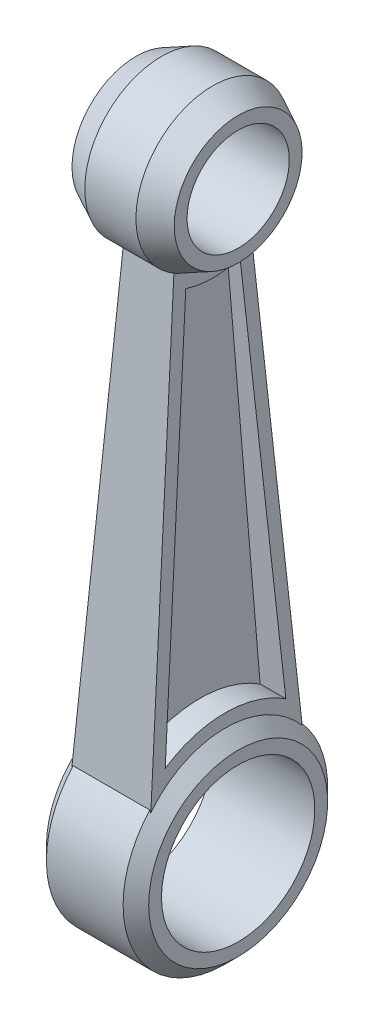
ISO-10303-21;
HEADER;
FILE_DESCRIPTION(('STEP AP214'),'2;1');
FILE_NAME('part.step','',(''),(''),'','','');
FILE_SCHEMA(('AUTOMOTIVE_DESIGN { 1 0 10303 214 1 1 1 1 }'));
ENDSEC;
DATA;
#1=APPLICATION_CONTEXT('core data for automotive mechanical design processes');
#2=APPLICATION_PROTOCOL_DEFINITION('international standard','automotive_design',2000,#1);
#3=PRODUCT_CONTEXT('',#1,'mechanical');
#4=PRODUCT('Part','Part','',(#3));
#5=PRODUCT_RELATED_PRODUCT_CATEGORY('part','',(#4));
#6=PRODUCT_DEFINITION_FORMATION('','',#4);
#7=PRODUCT_DEFINITION_CONTEXT('part definition',#1,'design');
#8=PRODUCT_DEFINITION('design','',#6,#7);
#9=PRODUCT_DEFINITION_SHAPE('','',#8);
#10=(LENGTH_UNIT() NAMED_UNIT(*) SI_UNIT(.MILLI.,.METRE.));
#11=(NAMED_UNIT(*) PLANE_ANGLE_UNIT() SI_UNIT($,.RADIAN.));
#12=(NAMED_UNIT(*) SI_UNIT($,.STERADIAN.) SOLID_ANGLE_UNIT());
#13=UNCERTAINTY_MEASURE_WITH_UNIT(LENGTH_MEASURE(1.E-05),#10,'distance_accuracy_value','');
#14=(GEOMETRIC_REPRESENTATION_CONTEXT(3) GLOBAL_UNCERTAINTY_ASSIGNED_CONTEXT((#13)) GLOBAL_UNIT_ASSIGNED_CONTEXT((#10,
#11,#12)) REPRESENTATION_CONTEXT('',''));
#15=CARTESIAN_POINT('',(0.,0.,0.));
#16=DIRECTION('',(0.,0.,1.));
#17=DIRECTION('',(1.,0.,0.));
#18=AXIS2_PLACEMENT_3D('',#15,#16,#17);
#19=CARTESIAN_POINT('',(0.,0.,0.));
#20=DIRECTION('',(-1.,0.,0.));
#21=DIRECTION('',(0.,0.,1.));
#22=AXIS2_PLACEMENT_3D('',#19,#20,#21);
#23=CYLINDRICAL_SURFACE('',#22,6.);
#24=CARTESIAN_POINT('',(4.,0.,0.));
#25=DIRECTION('',(-1.,0.,0.));
#26=DIRECTION('',(0.,0.,1.));
#27=AXIS2_PLACEMENT_3D('',#24,#25,#26);
#28=CIRCLE('',#27,6.);
#29=CARTESIAN_POINT('',(4.,0.,6.));
#30=VERTEX_POINT('',#29);
#31=EDGE_CURVE('E295',#30,#30,#28,.T.);
#32=ORIENTED_EDGE('',*,*,#31,.F.);
#33=EDGE_LOOP('',(#32));
#34=FACE_BOUND('',#33,.T.);
#35=CARTESIAN_POINT('',(-4.,0.,0.));
#36=DIRECTION('',(-1.,0.,0.));
#37=DIRECTION('',(0.,0.,1.));
#38=AXIS2_PLACEMENT_3D('',#35,#36,#37);
#39=CIRCLE('',#38,6.);
#40=CARTESIAN_POINT('',(-4.,0.,6.));
#41=VERTEX_POINT('',#40);
#42=EDGE_CURVE('E222',#41,#41,#39,.T.);
#43=ORIENTED_EDGE('',*,*,#42,.T.);
#44=EDGE_LOOP('',(#43));
#45=FACE_BOUND('',#44,.T.);
#46=ADVANCED_FACE('F38',(#34,#45),#23,.F.);
#47=CARTESIAN_POINT('',(4.,6.,0.));
#48=DIRECTION('',(-1.,0.,0.));
#49=DIRECTION('',(0.,0.,1.));
#50=AXIS2_PLACEMENT_3D('',#47,#48,#49);
#51=PLANE('',#50);
#52=CARTESIAN_POINT('',(4.,0.,0.));
#53=DIRECTION('',(-1.,0.,0.));
#54=DIRECTION('',(0.,0.,1.));
#55=AXIS2_PLACEMENT_3D('',#52,#53,#54);
#56=CIRCLE('',#55,7.);
#57=CARTESIAN_POINT('',(4.,0.,7.));
#58=VERTEX_POINT('',#57);
#59=EDGE_CURVE('E298',#58,#58,#56,.T.);
#60=ORIENTED_EDGE('',*,*,#59,.F.);
#61=EDGE_LOOP('',(#60));
#62=FACE_BOUND('',#61,.T.);
#63=ORIENTED_EDGE('',*,*,#31,.T.);
#64=EDGE_LOOP('',(#63));
#65=FACE_BOUND('',#64,.T.);
#66=ADVANCED_FACE('F286',(#62,#65),#51,.F.);
#67=CARTESIAN_POINT('',(4.,0.,0.));
#68=DIRECTION('',(-1.,0.,0.));
#69=DIRECTION('',(0.,0.,1.));
#70=AXIS2_PLACEMENT_3D('',#67,#68,#69);
#71=CONICAL_SURFACE('',#70,7.,0.785398163397448);
#72=CARTESIAN_POINT('',(3.25,0.25,0.));
#73=DIRECTION('',(0.9994801143397,0.032241294010958,0.));
#74=DIRECTION('',(-0.032241294010958,0.9994801143397,0.));
#75=AXIS2_PLACEMENT_3D('',#72,#73,#74);
#76=ELLIPSE('',#75,7.75403120963541,7.74596669241483);
#77=CARTESIAN_POINT('',(3.08888077576671,5.24469595123218,-5.92275035428325));
#78=VERTEX_POINT('',#77);
#79=CARTESIAN_POINT('',(3.08888077576671,5.24469595123218,5.92275035428325));
#80=VERTEX_POINT('',#79);
#81=EDGE_CURVE('E616',#78,#80,#76,.T.);
#82=ORIENTED_EDGE('',*,*,#81,.T.);
#83=CARTESIAN_POINT('',(3.11854575595028,5.19505550480803,5.92694856591595));
#84=CARTESIAN_POINT('',(3.09894655584697,5.22796007612366,5.92416574738757));
#85=CARTESIAN_POINT('',(3.07925147549856,5.26080718765726,5.92138778837079));
#86=CARTESIAN_POINT('',(3.03966955682412,5.32638648699748,5.91584158971249));
#87=CARTESIAN_POINT('',(3.01978271852244,5.35911867481869,5.91307335006974));
#88=CARTESIAN_POINT('',(2.9998,5.39179340287246,5.91030996993737));
#89=B_SPLINE_CURVE_WITH_KNOTS('',3,(#83,#84,#85,#86,#87,#88),.UNSPECIFIED.,.F.,.F.,(4,2,4),(0.,
0.115199452433468,0.230398890241465),.UNSPECIFIED.);
#90=CARTESIAN_POINT('',(3.,5.39146631945272,5.91033763216679));
#91=VERTEX_POINT('',#90);
#92=EDGE_CURVE('E392',#80,#91,#89,.T.);
#93=ORIENTED_EDGE('',*,*,#92,.T.);
#94=CARTESIAN_POINT('',(3.,0.,0.));
#95=DIRECTION('',(-1.,0.,0.));
#96=DIRECTION('',(0.,0.,1.));
#97=AXIS2_PLACEMENT_3D('',#94,#95,#96);
#98=CIRCLE('',#97,8.);
#99=CARTESIAN_POINT('',(3.,5.39146631945272,-5.91033763216679));
#100=VERTEX_POINT('',#99);
#101=EDGE_CURVE('E303',#100,#91,#98,.T.);
#102=ORIENTED_EDGE('',*,*,#101,.F.);
#103=CARTESIAN_POINT('',(2.9998,5.39179340287246,-5.91030996993737));
#104=CARTESIAN_POINT('',(3.01978271852244,5.35911867481869,-5.91307335006974));
#105=CARTESIAN_POINT('',(3.03966955682412,5.32638648699748,-5.91584158971249));
#106=CARTESIAN_POINT('',(3.07925147549855,5.26080718765726,-5.92138778837078));
#107=CARTESIAN_POINT('',(3.09894655584697,5.22796007612367,-5.92416574738757));
#108=CARTESIAN_POINT('',(3.11854575595027,5.19505550480804,-5.92694856591595));
#109=B_SPLINE_CURVE_WITH_KNOTS('',3,(#103,#104,#105,#106,#107,#108),.UNSPECIFIED.,.F.,.F.,(4,2,
4),(0.,0.115199437807991,0.230398890241453),.UNSPECIFIED.);
#110=EDGE_CURVE('E65',#100,#78,#109,.T.);
#111=ORIENTED_EDGE('',*,*,#110,.T.);
#112=EDGE_LOOP('',(#82,#93,#102,#111));
#113=FACE_BOUND('',#112,.T.);
#114=ORIENTED_EDGE('',*,*,#59,.T.);
#115=EDGE_LOOP('',(#114));
#116=FACE_BOUND('',#115,.T.);
#117=ADVANCED_FACE('F291',(#113,#116),#71,.T.);
#118=CARTESIAN_POINT('',(0.,0.,0.));
#119=DIRECTION('',(-1.,0.,0.));
#120=DIRECTION('',(0.,0.,1.));
#121=AXIS2_PLACEMENT_3D('',#118,#119,#120);
#122=CYLINDRICAL_SURFACE('',#121,8.);
#123=ORIENTED_EDGE('',*,*,#101,.T.);
#124=DIRECTION('',(-1.,0.,0.));
#125=VECTOR('',#124,1.);
#126=CARTESIAN_POINT('',(0.,5.39146631945272,5.91033763216679));
#127=LINE('',#126,#125);
#128=CARTESIAN_POINT('',(-3.,5.39146631945272,5.91033763216679));
#129=VERTEX_POINT('',#128);
#130=EDGE_CURVE('E300',#91,#129,#127,.T.);
#131=ORIENTED_EDGE('',*,*,#130,.T.);
#132=CARTESIAN_POINT('',(-3.,0.,0.));
#133=DIRECTION('',(-1.,0.,0.));
#134=DIRECTION('',(0.,0.,1.));
#135=AXIS2_PLACEMENT_3D('',#132,#133,#134);
#136=CIRCLE('',#135,8.);
#137=CARTESIAN_POINT('',(-3.,5.39146631945272,-5.91033763216679));
#138=VERTEX_POINT('',#137);
#139=EDGE_CURVE('E274',#138,#129,#136,.T.);
#140=ORIENTED_EDGE('',*,*,#139,.F.);
#141=DIRECTION('',(-1.,0.,0.));
#142=VECTOR('',#141,1.);
#143=CARTESIAN_POINT('',(0.,5.39146631945272,-5.91033763216679));
#144=LINE('',#143,#142);
#145=EDGE_CURVE('E297',#138,#100,#144,.F.);
#146=ORIENTED_EDGE('',*,*,#145,.T.);
#147=EDGE_LOOP('',(#123,#131,#140,#146));
#148=FACE_BOUND('',#147,.T.);
#149=ADVANCED_FACE('F404',(#148),#122,.T.);
#150=CARTESIAN_POINT('',(40.0032823696505,39.8038475772934,3.));
#151=DIRECTION('',(0.,0.0842715600283298,0.996442825339413));
#152=DIRECTION('',(0.,-0.996442825339413,0.0842715600283299));
#153=AXIS2_PLACEMENT_3D('',#150,#151,#152);
#154=PLANE('',#153);
#155=ORIENTED_EDGE('',*,*,#92,.F.);
#156=DIRECTION('',(-0.0321267246803745,0.995928465091609,-0.0842280593483142));
#157=VECTOR('',#156,1.);
#158=CARTESIAN_POINT('',(2.01332038910499,38.5870679377456,3.10290597295482));
#159=LINE('',#158,#157);
#160=CARTESIAN_POINT('',(1.97406943299054,39.8038475772934,3.));
#161=VERTEX_POINT('',#160);
#162=EDGE_CURVE('E612',#80,#161,#159,.T.);
#163=ORIENTED_EDGE('',*,*,#162,.T.);
#164=DIRECTION('',(-1.,0.,0.));
#165=VECTOR('',#164,1.);
#166=CARTESIAN_POINT('',(40.0032823696505,39.8038475772934,3.));
#167=LINE('',#166,#165);
#168=CARTESIAN_POINT('',(-1.97406943299054,39.8038475772934,3.));
#169=VERTEX_POINT('',#168);
#170=EDGE_CURVE('E394',#161,#169,#167,.T.);
#171=ORIENTED_EDGE('',*,*,#170,.T.);
#172=DIRECTION('',(0.0321267246803745,0.995928465091609,-0.0842280593483142));
#173=VECTOR('',#172,1.);
#174=CARTESIAN_POINT('',(-2.01332038910499,38.5870679377456,3.10290597295482));
#175=LINE('',#174,#173);
#176=CARTESIAN_POINT('',(-3.08888077576671,5.24469595123218,5.92275035428325));
#177=VERTEX_POINT('',#176);
#178=EDGE_CURVE('E643',#177,#169,#175,.T.);
#179=ORIENTED_EDGE('',*,*,#178,.F.);
#180=CARTESIAN_POINT('',(-3.11854575595028,5.19505550480803,5.92694856591595));
#181=CARTESIAN_POINT('',(-3.09894655584697,5.22796007612366,5.92416574738757));
#182=CARTESIAN_POINT('',(-3.07925147549856,5.26080718765726,5.92138778837079));
#183=CARTESIAN_POINT('',(-3.03966955682412,5.32638648699748,5.91584158971249));
#184=CARTESIAN_POINT('',(-3.01978271852244,5.35911867481869,5.91307335006974));
#185=CARTESIAN_POINT('',(-2.9998,5.39179340287246,5.91030996993737));
#186=B_SPLINE_CURVE_WITH_KNOTS('',3,(#180,#181,#182,#183,#184,#185),.UNSPECIFIED.,.F.,.F.,(4,2,
4),(0.,0.115199452433468,0.230398890241465),.UNSPECIFIED.);
#187=EDGE_CURVE('E264',#177,#129,#186,.T.);
#188=ORIENTED_EDGE('',*,*,#187,.T.);
#189=ORIENTED_EDGE('',*,*,#130,.F.);
#190=EDGE_LOOP('',(#155,#163,#171,#179,#188,#189));
#191=FACE_BOUND('',#190,.T.);
#192=ADVANCED_FACE('F382',(#191),#154,.T.);
#193=CARTESIAN_POINT('',(40.0032823696505,4.33128156554154,-6.));
#194=DIRECTION('',(0.,0.0842715600283299,-0.996442825339413));
#195=DIRECTION('',(0.,0.996442825339413,0.0842715600283299));
#196=AXIS2_PLACEMENT_3D('',#193,#194,#195);
#197=PLANE('',#196);
#198=ORIENTED_EDGE('',*,*,#110,.F.);
#199=ORIENTED_EDGE('',*,*,#145,.F.);
#200=CARTESIAN_POINT('',(-2.9998,5.39179340287246,-5.91030996993737));
#201=CARTESIAN_POINT('',(-3.01978271852244,5.35911867481869,-5.91307335006974));
#202=CARTESIAN_POINT('',(-3.03966955682412,5.32638648699748,-5.91584158971249));
#203=CARTESIAN_POINT('',(-3.07925147549855,5.26080718765726,-5.92138778837078));
#204=CARTESIAN_POINT('',(-3.09894655584697,5.22796007612367,-5.92416574738757));
#205=CARTESIAN_POINT('',(-3.11854575595027,5.19505550480804,-5.92694856591595));
#206=B_SPLINE_CURVE_WITH_KNOTS('',3,(#200,#201,#202,#203,#204,#205),.UNSPECIFIED.,.F.,.F.,(4,2,
4),(0.,0.115199437807991,0.230398890241453),.UNSPECIFIED.);
#207=CARTESIAN_POINT('',(-3.08888077576671,5.24469595123218,-5.92275035428325));
#208=VERTEX_POINT('',#207);
#209=EDGE_CURVE('E257',#138,#208,#206,.T.);
#210=ORIENTED_EDGE('',*,*,#209,.T.);
#211=DIRECTION('',(-0.0321267246803745,-0.995928465091609,-0.0842280593483142));
#212=VECTOR('',#211,1.);
#213=CARTESIAN_POINT('',(-3.15641567421863,3.15111409922261,-6.09980959363875));
#214=LINE('',#213,#212);
#215=CARTESIAN_POINT('',(-1.97406943299054,39.8038475772933,-3.));
#216=VERTEX_POINT('',#215);
#217=EDGE_CURVE('E638',#216,#208,#214,.T.);
#218=ORIENTED_EDGE('',*,*,#217,.F.);
#219=DIRECTION('',(-1.,0.,0.));
#220=VECTOR('',#219,1.);
#221=CARTESIAN_POINT('',(40.0032823696505,39.8038475772934,-3.));
#222=LINE('',#221,#220);
#223=CARTESIAN_POINT('',(1.97406943299054,39.8038475772933,-3.));
#224=VERTEX_POINT('',#223);
#225=EDGE_CURVE('E629',#224,#216,#222,.T.);
#226=ORIENTED_EDGE('',*,*,#225,.F.);
#227=DIRECTION('',(0.0321267246803745,-0.995928465091609,-0.0842280593483142));
#228=VECTOR('',#227,1.);
#229=CARTESIAN_POINT('',(3.15641567421863,3.15111409922261,-6.09980959363875));
#230=LINE('',#229,#228);
#231=EDGE_CURVE('E393',#224,#78,#230,.T.);
#232=ORIENTED_EDGE('',*,*,#231,.T.);
#233=EDGE_LOOP('',(#198,#199,#210,#218,#226,#232));
#234=FACE_BOUND('',#233,.T.);
#235=ADVANCED_FACE('F378',(#234),#197,.T.);
#236=CARTESIAN_POINT('',(3.,8.,-10.));
#237=DIRECTION('',(0.9994801143397,0.032241294010958,0.));
#238=DIRECTION('',(-0.032241294010958,0.9994801143397,0.));
#239=AXIS2_PLACEMENT_3D('',#236,#237,#238);
#240=PLANE('',#239);
#241=CARTESIAN_POINT('',(3.0123442683023,7.61732768262875,4.7185213239117));
#242=CARTESIAN_POINT('',(3.0102044881385,7.68366086770661,4.61505323843856));
#243=CARTESIAN_POINT('',(3.00813405511251,7.74784429151209,4.5102205905555));
#244=CARTESIAN_POINT('',(3.00413663291661,7.87176437958521,4.2979526840919));
#245=CARTESIAN_POINT('',(3.0022096482274,7.93150090495072,4.19051734435318));
#246=CARTESIAN_POINT('',(2.99665253397163,8.10377144687947,3.86458597719886));
#247=CARTESIAN_POINT('',(2.99324468004882,8.20941491848667,3.64238911458675));
#248=CARTESIAN_POINT('',(2.98705539774682,8.40128266984859,3.19001858887776));
#249=CARTESIAN_POINT('',(2.9842734467074,8.4875231520707,2.9598517678393));
#250=CARTESIAN_POINT('',(2.97933751729972,8.64053696370868,2.4931193844221));
#251=CARTESIAN_POINT('',(2.97718355069055,8.70730992859302,2.25655370231458));
#252=CARTESIAN_POINT('',(2.97352583713385,8.82069904885063,1.77853778763008));
#253=CARTESIAN_POINT('',(2.97202233592799,8.86730758623239,1.53708574501498));
#254=CARTESIAN_POINT('',(2.96967550548526,8.94005932995682,1.05111627640722));
#255=CARTESIAN_POINT('',(2.9688321731412,8.96620263262287,0.806598864847796));
#256=CARTESIAN_POINT('',(2.96781408207259,8.99776345574956,0.316200178438085));
#257=CARTESIAN_POINT('',(2.96763940111526,9.00317856542682,0.0703187482764238));
#258=CARTESIAN_POINT('',(2.96795746508294,8.99331858242873,-0.421028528246792));
#259=CARTESIAN_POINT('',(2.96845020946721,8.97804350651632,-0.666494374944886));
#260=CARTESIAN_POINT('',(2.97010254095381,8.92682123043178,-1.15527001477733));
#261=CARTESIAN_POINT('',(2.97126216258102,8.89087295998848,-1.39857969562264));
#262=CARTESIAN_POINT('',(2.97423682707916,8.79865836054593,-1.88134146000542));
#263=CARTESIAN_POINT('',(2.97605194378714,8.74238974259864,-2.1207931057862));
#264=CARTESIAN_POINT('',(2.9803242879185,8.6099470745266,-2.59386402516513));
#265=CARTESIAN_POINT('',(2.98278087832519,8.53379277191908,-2.82748883437489));
#266=CARTESIAN_POINT('',(2.98831899806652,8.36211105993794,-3.28739443557703));
#267=CARTESIAN_POINT('',(2.99140024987508,8.26659225387259,-3.51367843735128));
#268=CARTESIAN_POINT('',(2.99736937685258,8.08154931756988,-3.90512656751904));
#269=CARTESIAN_POINT('',(3.00013198924273,7.99590833347538,-4.07213769466456));
#270=CARTESIAN_POINT('',(3.00452661910463,7.85967480775647,-4.31810922040449));
#271=CARTESIAN_POINT('',(3.00603175434483,7.81301561531028,-4.39926831264563));
#272=CARTESIAN_POINT('',(3.0091256097148,7.71710609884127,-4.56006297798779));
#273=CARTESIAN_POINT('',(3.01071434797195,7.66785521286963,-4.63969821552934));
#274=CARTESIAN_POINT('',(3.0123442683023,7.61732768262881,-4.71852132391253));
#275=B_SPLINE_CURVE_WITH_KNOTS('',3,(#241,#242,#243,#244,#245,#246,#247,#248,#249,#250,#251,
#252,#253,#254,#255,#256,#257,#258,#259,#260,#261,#262,#263,#264,#265,#266,#267,#268,#269,#270,
#271,#272,#273,#274),.UNSPECIFIED.,.F.,.F.,(4,2,2,2,2,2,2,2,2,2,2,2,2,2,2,2,4),(0.,
0.368718822550497,0.737449157476594,1.47464149650328,2.21121593915894,2.94780417337045,
3.68467044340732,4.42153324522674,5.15848174494706,5.89542964760054,6.63241570619125,
7.36948480712367,8.10582472551082,8.84183821514826,9.40456969641888,9.68540988747047,
9.96631122516951),.UNSPECIFIED.);
#276=CARTESIAN_POINT('',(3.0123442683023,7.61732768262875,4.7185213239117));
#277=VERTEX_POINT('',#276);
#278=CARTESIAN_POINT('',(3.0123442683023,7.61732768262881,-4.71852132391253));
#279=VERTEX_POINT('',#278);
#280=EDGE_CURVE('E11',#277,#279,#275,.T.);
#281=ORIENTED_EDGE('',*,*,#280,.F.);
#282=DIRECTION('',(0.0321267246803746,-0.995928465091613,0.0842280593482607));
#283=VECTOR('',#282,1.);
#284=CARTESIAN_POINT('',(2.96025967298551,9.23195013744904,4.58196882971512));
#285=LINE('',#284,#283);
#286=CARTESIAN_POINT('',(2.02164147130858,38.3291143894341,2.12115184999676));
#287=VERTEX_POINT('',#286);
#288=EDGE_CURVE('E51',#287,#277,#285,.T.);
#289=ORIENTED_EDGE('',*,*,#288,.F.);
#290=CARTESIAN_POINT('',(1.80645161290323,45.,0.));
#291=DIRECTION('',(0.9994801143397,0.032241294010958,0.));
#292=DIRECTION('',(0.032241294010958,-0.9994801143397,0.));
#293=AXIS2_PLACEMENT_3D('',#290,#291,#292);
#294=ELLIPSE('',#293,7.00364109257393,7.00000000000001);
#295=CARTESIAN_POINT('',(2.02164147130858,38.3291143894341,-2.12115184999676));
#296=VERTEX_POINT('',#295);
#297=EDGE_CURVE('E310',#296,#287,#294,.F.);
#298=ORIENTED_EDGE('',*,*,#297,.F.);
#299=DIRECTION('',(-0.0321267246803745,0.995928465091611,0.0842280593482875));
#300=VECTOR('',#299,1.);
#301=CARTESIAN_POINT('',(3.01437910644639,7.5542477001618,-4.72385614934744));
#302=LINE('',#301,#300);
#303=EDGE_CURVE('E308',#279,#296,#302,.T.);
#304=ORIENTED_EDGE('',*,*,#303,.F.);
#305=EDGE_LOOP('',(#281,#289,#298,#304));
#306=FACE_BOUND('',#305,.T.);
#307=ORIENTED_EDGE('',*,*,#81,.F.);
#308=ORIENTED_EDGE('',*,*,#231,.F.);
#309=CARTESIAN_POINT('',(1.80645161290323,45.,0.));
#310=DIRECTION('',(0.9994801143397,0.032241294010958,0.));
#311=DIRECTION('',(-0.032241294010958,0.9994801143397,0.));
#312=AXIS2_PLACEMENT_3D('',#309,#310,#311);
#313=ELLIPSE('',#312,6.00312093649193,6.);
#314=CARTESIAN_POINT('',(2.,39.,0.));
#315=VERTEX_POINT('',#314);
#316=EDGE_CURVE('E622',#315,#224,#313,.T.);
#317=ORIENTED_EDGE('',*,*,#316,.F.);
#318=EDGE_CURVE('E619',#161,#315,#313,.T.);
#319=ORIENTED_EDGE('',*,*,#318,.F.);
#320=ORIENTED_EDGE('',*,*,#162,.F.);
#321=EDGE_LOOP('',(#307,#308,#317,#319,#320));
#322=FACE_BOUND('',#321,.T.);
#323=ADVANCED_FACE('F332',(#306,#322),#240,.T.);
#324=CARTESIAN_POINT('',(4.,49.,0.));
#325=DIRECTION('',(-1.,0.,0.));
#326=DIRECTION('',(0.,0.,1.));
#327=AXIS2_PLACEMENT_3D('',#324,#325,#326);
#328=PLANE('',#327);
#329=CARTESIAN_POINT('',(4.,45.,0.));
#330=DIRECTION('',(-1.,0.,0.));
#331=DIRECTION('',(0.,0.,1.));
#332=AXIS2_PLACEMENT_3D('',#329,#330,#331);
#333=CIRCLE('',#332,5.);
#334=CARTESIAN_POINT('',(4.,45.,5.));
#335=VERTEX_POINT('',#334);
#336=EDGE_CURVE('E620',#335,#335,#333,.T.);
#337=ORIENTED_EDGE('',*,*,#336,.F.);
#338=EDGE_LOOP('',(#337));
#339=FACE_BOUND('',#338,.T.);
#340=CARTESIAN_POINT('',(4.,45.,0.));
#341=DIRECTION('',(-1.,0.,0.));
#342=DIRECTION('',(0.,0.,1.));
#343=AXIS2_PLACEMENT_3D('',#340,#341,#342);
#344=CIRCLE('',#343,4.);
#345=CARTESIAN_POINT('',(4.,45.,4.));
#346=VERTEX_POINT('',#345);
#347=EDGE_CURVE('E330',#346,#346,#344,.T.);
#348=ORIENTED_EDGE('',*,*,#347,.T.);
#349=EDGE_LOOP('',(#348));
#350=FACE_BOUND('',#349,.T.);
#351=ADVANCED_FACE('F373',(#339,#350),#328,.F.);
#352=CARTESIAN_POINT('',(4.,45.,0.));
#353=DIRECTION('',(-1.,0.,0.));
#354=DIRECTION('',(0.,0.,1.));
#355=AXIS2_PLACEMENT_3D('',#352,#353,#354);
#356=CONICAL_SURFACE('',#355,5.,0.463647609000806);
#357=CARTESIAN_POINT('',(2.,45.,0.));
#358=DIRECTION('',(-1.,0.,0.));
#359=DIRECTION('',(0.,0.,1.));
#360=AXIS2_PLACEMENT_3D('',#357,#358,#359);
#361=CIRCLE('',#360,6.);
#362=EDGE_CURVE('E624',#315,#315,#361,.T.);
#363=ORIENTED_EDGE('',*,*,#362,.F.);
#364=EDGE_LOOP('',(#363));
#365=FACE_BOUND('',#364,.T.);
#366=ORIENTED_EDGE('',*,*,#336,.T.);
#367=EDGE_LOOP('',(#366));
#368=FACE_BOUND('',#367,.T.);
#369=ADVANCED_FACE('F369',(#365,#368),#356,.T.);
#370=CARTESIAN_POINT('',(0.,45.,0.));
#371=DIRECTION('',(-1.,0.,0.));
#372=DIRECTION('',(0.,0.,1.));
#373=AXIS2_PLACEMENT_3D('',#370,#371,#372);
#374=CYLINDRICAL_SURFACE('',#373,6.);
#375=ORIENTED_EDGE('',*,*,#170,.F.);
#376=ORIENTED_EDGE('',*,*,#318,.T.);
#377=ORIENTED_EDGE('',*,*,#362,.T.);
#378=ORIENTED_EDGE('',*,*,#316,.T.);
#379=ORIENTED_EDGE('',*,*,#225,.T.);
#380=CARTESIAN_POINT('',(-1.80645161290323,45.,0.));
#381=DIRECTION('',(0.9994801143397,-0.032241294010958,0.));
#382=DIRECTION('',(0.032241294010958,0.9994801143397,0.));
#383=AXIS2_PLACEMENT_3D('',#380,#381,#382);
#384=ELLIPSE('',#383,6.00312093649193,6.);
#385=CARTESIAN_POINT('',(-2.,39.,0.));
#386=VERTEX_POINT('',#385);
#387=EDGE_CURVE('E634',#386,#216,#384,.T.);
#388=ORIENTED_EDGE('',*,*,#387,.F.);
#389=CARTESIAN_POINT('',(-2.,45.,0.));
#390=DIRECTION('',(-1.,0.,0.));
#391=DIRECTION('',(0.,0.,1.));
#392=AXIS2_PLACEMENT_3D('',#389,#390,#391);
#393=CIRCLE('',#392,6.);
#394=EDGE_CURVE('E652',#386,#386,#393,.T.);
#395=ORIENTED_EDGE('',*,*,#394,.F.);
#396=EDGE_CURVE('E642',#169,#386,#384,.T.);
#397=ORIENTED_EDGE('',*,*,#396,.F.);
#398=EDGE_LOOP('',(#375,#376,#377,#378,#379,#388,#395,#397));
#399=FACE_BOUND('',#398,.T.);
#400=ADVANCED_FACE('F365',(#399),#374,.T.);
#401=CARTESIAN_POINT('',(0.,45.,0.));
#402=DIRECTION('',(-1.,0.,0.));
#403=DIRECTION('',(0.,0.,1.));
#404=AXIS2_PLACEMENT_3D('',#401,#402,#403);
#405=CYLINDRICAL_SURFACE('',#404,4.);
#406=ORIENTED_EDGE('',*,*,#347,.F.);
#407=EDGE_LOOP('',(#406));
#408=FACE_BOUND('',#407,.T.);
#409=CARTESIAN_POINT('',(-4.,45.,0.));
#410=DIRECTION('',(-1.,0.,0.));
#411=DIRECTION('',(0.,0.,1.));
#412=AXIS2_PLACEMENT_3D('',#409,#410,#411);
#413=CIRCLE('',#412,4.);
#414=CARTESIAN_POINT('',(-4.,45.,4.));
#415=VERTEX_POINT('',#414);
#416=EDGE_CURVE('E210',#415,#415,#413,.T.);
#417=ORIENTED_EDGE('',*,*,#416,.T.);
#418=EDGE_LOOP('',(#417));
#419=FACE_BOUND('',#418,.T.);
#420=ADVANCED_FACE('F360',(#408,#419),#405,.F.);
#421=CARTESIAN_POINT('',(1.,7.61732768262875,4.7185213239117));
#422=CARTESIAN_POINT('',(1.,8.07025795693203,4.01198425534394));
#423=CARTESIAN_POINT('',(1.,8.4107405918881,3.2615503615427));
#424=CARTESIAN_POINT('',(1.,8.70234147082911,2.27119670865189));
#425=CARTESIAN_POINT('',(1.,8.75383204519997,2.07045986768153));
#426=CARTESIAN_POINT('',(1.,8.84279289802945,1.66351300299606));
#427=CARTESIAN_POINT('',(1.,8.88035061971134,1.45644603214192));
#428=CARTESIAN_POINT('',(1.,8.96990894859626,0.836431360684937));
#429=CARTESIAN_POINT('',(1.,9.02920540170382,0.00941084225722518));
#430=CARTESIAN_POINT('',(1.,8.97166067954541,-0.818259414860091));
#431=CARTESIAN_POINT('',(1.,8.85376903934497,-1.64626525339688));
#432=CARTESIAN_POINT('',(1.,8.76494999754429,-2.05569538009597));
#433=CARTESIAN_POINT('',(1.,8.5325251363334,-2.85069044441717));
#434=CARTESIAN_POINT('',(1.,8.3886016803718,-3.23863975479659));
#435=CARTESIAN_POINT('',(1.,8.04477705217635,-3.99525046964436));
#436=CARTESIAN_POINT('',(1.,7.84379330238342,-4.36525203680449));
#437=CARTESIAN_POINT('',(1.,7.61732768262881,-4.71852132391253));
#438=B_SPLINE_CURVE_WITH_KNOTS('',3,(#421,#422,#423,#424,#425,#426,#427,#428,#429,#430,#431,
#432,#433,#434,#435,#436,#437),.UNSPECIFIED.,.F.,.F.,(4,2,2,2,1,2,2,2,4),(0.,0.25,0.3125,0.375,
0.5,0.625,0.75,0.875,1.),.UNSPECIFIED.);
#439=DIRECTION('',(1.,0.,0.));
#440=VECTOR('',#439,1.);
#441=SURFACE_OF_LINEAR_EXTRUSION('',#438,#440);
#442=ORIENTED_EDGE('',*,*,#280,.T.);
#443=DIRECTION('',(1.,0.,0.));
#444=VECTOR('',#443,1.);
#445=CARTESIAN_POINT('',(1.,7.61732768262881,-4.71852132391253));
#446=LINE('',#445,#444);
#447=CARTESIAN_POINT('',(1.,7.61732768262881,-4.71852132391253));
#448=VERTEX_POINT('',#447);
#449=EDGE_CURVE('E58',#448,#279,#446,.T.);
#450=ORIENTED_EDGE('',*,*,#449,.F.);
#451=CARTESIAN_POINT('',(1.,7.61732768262881,-4.71852132391253));
#452=CARTESIAN_POINT('',(1.,7.84379330238342,-4.36525203680449));
#453=CARTESIAN_POINT('',(1.,8.04477705217635,-3.99525046964436));
#454=CARTESIAN_POINT('',(1.,8.3886016803718,-3.23863975479659));
#455=CARTESIAN_POINT('',(1.,8.5325251363334,-2.85069044441717));
#456=CARTESIAN_POINT('',(1.,8.76494999754429,-2.05569538009597));
#457=CARTESIAN_POINT('',(1.,8.85376903934497,-1.64626525339688));
#458=CARTESIAN_POINT('',(1.,8.97166067954541,-0.818259414860091));
#459=CARTESIAN_POINT('',(1.,9.02920540170382,0.00941084225722518));
#460=CARTESIAN_POINT('',(1.,8.96990894859626,0.836431360684937));
#461=CARTESIAN_POINT('',(1.,8.88035061971134,1.45644603214192));
#462=CARTESIAN_POINT('',(1.,8.84279289802945,1.66351300299606));
#463=CARTESIAN_POINT('',(1.,8.75383204519997,2.07045986768153));
#464=CARTESIAN_POINT('',(1.,8.70234147082911,2.27119670865189));
#465=CARTESIAN_POINT('',(1.,8.4107405918881,3.2615503615427));
#466=CARTESIAN_POINT('',(1.,8.07025795693203,4.01198425534394));
#467=CARTESIAN_POINT('',(1.,7.61732768262875,4.7185213239117));
#468=B_SPLINE_CURVE_WITH_KNOTS('',3,(#451,#452,#453,#454,#455,#456,#457,#458,#459,#460,#461,
#462,#463,#464,#465,#466,#467),.UNSPECIFIED.,.F.,.F.,(4,2,2,2,1,2,2,2,4),(0.,0.125,0.25,0.375,
0.5,0.625,0.6875,0.75,1.),.UNSPECIFIED.);
#469=CARTESIAN_POINT('',(1.,7.61732768262875,4.7185213239117));
#470=VERTEX_POINT('',#469);
#471=EDGE_CURVE('E236',#470,#448,#468,.F.);
#472=ORIENTED_EDGE('',*,*,#471,.F.);
#473=DIRECTION('',(1.,0.,0.));
#474=VECTOR('',#473,1.);
#475=CARTESIAN_POINT('',(1.,7.61732768262875,4.7185213239117));
#476=LINE('',#475,#474);
#477=EDGE_CURVE('E317',#470,#277,#476,.T.);
#478=ORIENTED_EDGE('',*,*,#477,.T.);
#479=EDGE_LOOP('',(#442,#450,#472,#478));
#480=FACE_BOUND('',#479,.T.);
#481=ADVANCED_FACE('F325',(#480),#441,.F.);
#482=CARTESIAN_POINT('',(1.,38.3291143894341,2.12115184999676));
#483=DIRECTION('',(0.,0.0842715600282763,0.996442825339417));
#484=DIRECTION('',(0.,-0.996442825339417,0.0842715600282763));
#485=AXIS2_PLACEMENT_3D('',#482,#483,#484);
#486=PLANE('',#485);
#487=ORIENTED_EDGE('',*,*,#288,.T.);
#488=ORIENTED_EDGE('',*,*,#477,.F.);
#489=DIRECTION('',(0.,-0.996442825339417,0.0842715600282763));
#490=VECTOR('',#489,1.);
#491=CARTESIAN_POINT('',(1.,38.3291143894341,2.12115184999676));
#492=LINE('',#491,#490);
#493=CARTESIAN_POINT('',(1.,38.3291143894341,2.12115184999676));
#494=VERTEX_POINT('',#493);
#495=EDGE_CURVE('E344',#494,#470,#492,.T.);
#496=ORIENTED_EDGE('',*,*,#495,.F.);
#497=DIRECTION('',(1.,0.,0.));
#498=VECTOR('',#497,1.);
#499=CARTESIAN_POINT('',(1.,38.3291143894341,2.12115184999676));
#500=LINE('',#499,#498);
#501=EDGE_CURVE('E320',#494,#287,#500,.T.);
#502=ORIENTED_EDGE('',*,*,#501,.T.);
#503=EDGE_LOOP('',(#487,#488,#496,#502));
#504=FACE_BOUND('',#503,.T.);
#505=ADVANCED_FACE('F315',(#504),#486,.F.);
#506=CARTESIAN_POINT('',(1.,45.,0.));
#507=DIRECTION('',(1.,0.,0.));
#508=DIRECTION('',(0.,0.,-1.));
#509=AXIS2_PLACEMENT_3D('',#506,#507,#508);
#510=CYLINDRICAL_SURFACE('',#509,7.00000000000001);
#511=ORIENTED_EDGE('',*,*,#297,.T.);
#512=ORIENTED_EDGE('',*,*,#501,.F.);
#513=CARTESIAN_POINT('',(1.,45.,0.));
#514=DIRECTION('',(-1.,0.,0.));
#515=DIRECTION('',(0.,0.,-1.));
#516=AXIS2_PLACEMENT_3D('',#513,#514,#515);
#517=CIRCLE('',#516,7.00000000000001);
#518=CARTESIAN_POINT('',(1.,38.3291143894341,-2.12115184999676));
#519=VERTEX_POINT('',#518);
#520=EDGE_CURVE('E340',#519,#494,#517,.T.);
#521=ORIENTED_EDGE('',*,*,#520,.F.);
#522=DIRECTION('',(1.,0.,0.));
#523=VECTOR('',#522,1.);
#524=CARTESIAN_POINT('',(1.,38.3291143894341,-2.12115184999676));
#525=LINE('',#524,#523);
#526=EDGE_CURVE('E336',#519,#296,#525,.T.);
#527=ORIENTED_EDGE('',*,*,#526,.T.);
#528=EDGE_LOOP('',(#511,#512,#521,#527));
#529=FACE_BOUND('',#528,.T.);
#530=ADVANCED_FACE('F339',(#529),#510,.T.);
#531=CARTESIAN_POINT('',(1.,7.61732768262881,-4.71852132391253));
#532=DIRECTION('',(0.,0.0842715600283032,-0.996442825339415));
#533=DIRECTION('',(0.,0.996442825339415,0.0842715600283032));
#534=AXIS2_PLACEMENT_3D('',#531,#532,#533);
#535=PLANE('',#534);
#536=ORIENTED_EDGE('',*,*,#303,.T.);
#537=ORIENTED_EDGE('',*,*,#526,.F.);
#538=DIRECTION('',(0.,0.996442825339415,0.0842715600283032));
#539=VECTOR('',#538,1.);
#540=CARTESIAN_POINT('',(1.,7.61732768262881,-4.71852132391253));
#541=LINE('',#540,#539);
#542=EDGE_CURVE('E686',#448,#519,#541,.T.);
#543=ORIENTED_EDGE('',*,*,#542,.F.);
#544=ORIENTED_EDGE('',*,*,#449,.T.);
#545=EDGE_LOOP('',(#536,#537,#543,#544));
#546=FACE_BOUND('',#545,.T.);
#547=ADVANCED_FACE('F335',(#546),#535,.F.);
#548=CARTESIAN_POINT('',(1.,8.99999510788732,0.00924840758482306));
#549=DIRECTION('',(1.,0.,0.));
#550=DIRECTION('',(0.,0.,-1.));
#551=AXIS2_PLACEMENT_3D('',#548,#549,#550);
#552=PLANE('',#551);
#553=ORIENTED_EDGE('',*,*,#471,.T.);
#554=ORIENTED_EDGE('',*,*,#542,.T.);
#555=ORIENTED_EDGE('',*,*,#520,.T.);
#556=ORIENTED_EDGE('',*,*,#495,.T.);
#557=EDGE_LOOP('',(#553,#554,#555,#556));
#558=FACE_BOUND('',#557,.T.);
#559=ADVANCED_FACE('F282',(#558),#552,.T.);
#560=CARTESIAN_POINT('',(-4.,6.,0.));
#561=DIRECTION('',(1.,0.,0.));
#562=DIRECTION('',(0.,0.,1.));
#563=AXIS2_PLACEMENT_3D('',#560,#561,#562);
#564=PLANE('',#563);
#565=CARTESIAN_POINT('',(-4.,0.,0.));
#566=DIRECTION('',(-1.,0.,0.));
#567=DIRECTION('',(0.,0.,1.));
#568=AXIS2_PLACEMENT_3D('',#565,#566,#567);
#569=CIRCLE('',#568,7.);
#570=CARTESIAN_POINT('',(-4.,0.,7.));
#571=VERTEX_POINT('',#570);
#572=EDGE_CURVE('E225',#571,#571,#569,.T.);
#573=ORIENTED_EDGE('',*,*,#572,.T.);
#574=EDGE_LOOP('',(#573));
#575=FACE_BOUND('',#574,.T.);
#576=ORIENTED_EDGE('',*,*,#42,.F.);
#577=EDGE_LOOP('',(#576));
#578=FACE_BOUND('',#577,.T.);
#579=ADVANCED_FACE('F252',(#575,#578),#564,.F.);
#580=CARTESIAN_POINT('',(-4.,0.,0.));
#581=DIRECTION('',(1.,0.,0.));
#582=DIRECTION('',(0.,0.,1.));
#583=AXIS2_PLACEMENT_3D('',#580,#581,#582);
#584=CONICAL_SURFACE('',#583,7.,0.785398163397448);
#585=CARTESIAN_POINT('',(-3.25,0.25,0.));
#586=DIRECTION('',(0.9994801143397,-0.032241294010958,0.));
#587=DIRECTION('',(0.032241294010958,0.9994801143397,0.));
#588=AXIS2_PLACEMENT_3D('',#585,#586,#587);
#589=ELLIPSE('',#588,7.75403120963541,7.74596669241483);
#590=EDGE_CURVE('E271',#208,#177,#589,.T.);
#591=ORIENTED_EDGE('',*,*,#590,.F.);
#592=ORIENTED_EDGE('',*,*,#209,.F.);
#593=ORIENTED_EDGE('',*,*,#139,.T.);
#594=ORIENTED_EDGE('',*,*,#187,.F.);
#595=EDGE_LOOP('',(#591,#592,#593,#594));
#596=FACE_BOUND('',#595,.T.);
#597=ORIENTED_EDGE('',*,*,#572,.F.);
#598=EDGE_LOOP('',(#597));
#599=FACE_BOUND('',#598,.T.);
#600=ADVANCED_FACE('F246',(#596,#599),#584,.T.);
#601=CARTESIAN_POINT('',(-3.,8.,-10.));
#602=DIRECTION('',(-0.9994801143397,0.032241294010958,0.));
#603=DIRECTION('',(0.032241294010958,0.9994801143397,0.));
#604=AXIS2_PLACEMENT_3D('',#601,#602,#603);
#605=PLANE('',#604);
#606=CARTESIAN_POINT('',(-3.0123442683023,7.61732768262875,4.7185213239117));
#607=CARTESIAN_POINT('',(-3.0102044881385,7.68366086770661,4.61505323843856));
#608=CARTESIAN_POINT('',(-3.00813405511251,7.74784429151209,4.5102205905555));
#609=CARTESIAN_POINT('',(-3.00413663291661,7.87176437958521,4.2979526840919));
#610=CARTESIAN_POINT('',(-3.0022096482274,7.93150090495072,4.19051734435318));
#611=CARTESIAN_POINT('',(-2.99665253397163,8.10377144687947,3.86458597719886));
#612=CARTESIAN_POINT('',(-2.99324468004882,8.20941491848667,3.64238911458675));
#613=CARTESIAN_POINT('',(-2.98705539774682,8.40128266984859,3.19001858887776));
#614=CARTESIAN_POINT('',(-2.9842734467074,8.4875231520707,2.9598517678393));
#615=CARTESIAN_POINT('',(-2.97933751729972,8.64053696370868,2.4931193844221));
#616=CARTESIAN_POINT('',(-2.97718355069055,8.70730992859302,2.25655370231458));
#617=CARTESIAN_POINT('',(-2.97352583713385,8.82069904885063,1.77853778763008));
#618=CARTESIAN_POINT('',(-2.97202233592799,8.86730758623239,1.53708574501498));
#619=CARTESIAN_POINT('',(-2.96967550548526,8.94005932995682,1.05111627640722));
#620=CARTESIAN_POINT('',(-2.9688321731412,8.96620263262287,0.806598864847796));
#621=CARTESIAN_POINT('',(-2.96781408207259,8.99776345574956,0.316200178438085));
#622=CARTESIAN_POINT('',(-2.96763940111526,9.00317856542682,0.0703187482764238));
#623=CARTESIAN_POINT('',(-2.96795746508294,8.99331858242873,-0.421028528246792));
#624=CARTESIAN_POINT('',(-2.96845020946721,8.97804350651632,-0.666494374944886));
#625=CARTESIAN_POINT('',(-2.97010254095381,8.92682123043178,-1.15527001477733));
#626=CARTESIAN_POINT('',(-2.97126216258102,8.89087295998848,-1.39857969562264));
#627=CARTESIAN_POINT('',(-2.97423682707916,8.79865836054593,-1.88134146000542));
#628=CARTESIAN_POINT('',(-2.97605194378714,8.74238974259864,-2.1207931057862));
#629=CARTESIAN_POINT('',(-2.9803242879185,8.6099470745266,-2.59386402516513));
#630=CARTESIAN_POINT('',(-2.98278087832519,8.53379277191908,-2.82748883437489));
#631=CARTESIAN_POINT('',(-2.98831899806652,8.36211105993794,-3.28739443557703));
#632=CARTESIAN_POINT('',(-2.99140024987508,8.26659225387259,-3.51367843735128));
#633=CARTESIAN_POINT('',(-2.99736937685258,8.08154931756988,-3.90512656751904));
#634=CARTESIAN_POINT('',(-3.00013198924273,7.99590833347538,-4.07213769466456));
#635=CARTESIAN_POINT('',(-3.00452661910463,7.85967480775647,-4.31810922040449));
#636=CARTESIAN_POINT('',(-3.00603175434483,7.81301561531028,-4.39926831264563));
#637=CARTESIAN_POINT('',(-3.0091256097148,7.71710609884127,-4.56006297798779));
#638=CARTESIAN_POINT('',(-3.01071434797195,7.66785521286963,-4.63969821552934));
#639=CARTESIAN_POINT('',(-3.0123442683023,7.61732768262881,-4.71852132391253));
#640=B_SPLINE_CURVE_WITH_KNOTS('',3,(#606,#607,#608,#609,#610,#611,#612,#613,#614,#615,#616,
#617,#618,#619,#620,#621,#622,#623,#624,#625,#626,#627,#628,#629,#630,#631,#632,#633,#634,#635,
#636,#637,#638,#639),.UNSPECIFIED.,.F.,.F.,(4,2,2,2,2,2,2,2,2,2,2,2,2,2,2,2,4),(0.,
0.368718822550497,0.737449157476594,1.47464149650328,2.21121593915894,2.94780417337045,
3.68467044340732,4.42153324522674,5.15848174494706,5.89542964760054,6.63241570619125,
7.36948480712367,8.10582472551082,8.84183821514826,9.40456969641888,9.68540988747047,
9.96631122516951),.UNSPECIFIED.);
#641=CARTESIAN_POINT('',(-3.0123442683023,7.61732768262875,4.7185213239117));
#642=VERTEX_POINT('',#641);
#643=CARTESIAN_POINT('',(-3.0123442683023,7.61732768262881,-4.71852132391253));
#644=VERTEX_POINT('',#643);
#645=EDGE_CURVE('E221',#642,#644,#640,.T.);
#646=ORIENTED_EDGE('',*,*,#645,.T.);
#647=DIRECTION('',(0.0321267246803745,0.995928465091611,0.0842280593482875));
#648=VECTOR('',#647,1.);
#649=CARTESIAN_POINT('',(-3.01437910644639,7.5542477001618,-4.72385614934744));
#650=LINE('',#649,#648);
#651=CARTESIAN_POINT('',(-2.02164147130858,38.3291143894341,-2.12115184999676));
#652=VERTEX_POINT('',#651);
#653=EDGE_CURVE('E166',#644,#652,#650,.T.);
#654=ORIENTED_EDGE('',*,*,#653,.T.);
#655=CARTESIAN_POINT('',(-1.80645161290323,45.,0.));
#656=DIRECTION('',(0.9994801143397,-0.032241294010958,0.));
#657=DIRECTION('',(-0.032241294010958,-0.9994801143397,0.));
#658=AXIS2_PLACEMENT_3D('',#655,#656,#657);
#659=ELLIPSE('',#658,7.00364109257393,7.00000000000001);
#660=CARTESIAN_POINT('',(-2.02164147130858,38.3291143894341,2.12115184999676));
#661=VERTEX_POINT('',#660);
#662=EDGE_CURVE('E213',#652,#661,#659,.F.);
#663=ORIENTED_EDGE('',*,*,#662,.T.);
#664=DIRECTION('',(-0.0321267246803746,-0.995928465091613,0.0842280593482607));
#665=VECTOR('',#664,1.);
#666=CARTESIAN_POINT('',(-2.96025967298551,9.23195013744904,4.58196882971512));
#667=LINE('',#666,#665);
#668=EDGE_CURVE('E217',#661,#642,#667,.T.);
#669=ORIENTED_EDGE('',*,*,#668,.T.);
#670=EDGE_LOOP('',(#646,#654,#663,#669));
#671=FACE_BOUND('',#670,.T.);
#672=ORIENTED_EDGE('',*,*,#590,.T.);
#673=ORIENTED_EDGE('',*,*,#178,.T.);
#674=ORIENTED_EDGE('',*,*,#396,.T.);
#675=ORIENTED_EDGE('',*,*,#387,.T.);
#676=ORIENTED_EDGE('',*,*,#217,.T.);
#677=EDGE_LOOP('',(#672,#673,#674,#675,#676));
#678=FACE_BOUND('',#677,.T.);
#679=ADVANCED_FACE('F219',(#671,#678),#605,.T.);
#680=CARTESIAN_POINT('',(-4.,49.,0.));
#681=DIRECTION('',(1.,0.,0.));
#682=DIRECTION('',(0.,0.,1.));
#683=AXIS2_PLACEMENT_3D('',#680,#681,#682);
#684=PLANE('',#683);
#685=CARTESIAN_POINT('',(-4.,45.,0.));
#686=DIRECTION('',(-1.,0.,0.));
#687=DIRECTION('',(0.,0.,1.));
#688=AXIS2_PLACEMENT_3D('',#685,#686,#687);
#689=CIRCLE('',#688,5.);
#690=CARTESIAN_POINT('',(-4.,45.,5.));
#691=VERTEX_POINT('',#690);
#692=EDGE_CURVE('E649',#691,#691,#689,.T.);
#693=ORIENTED_EDGE('',*,*,#692,.T.);
#694=EDGE_LOOP('',(#693));
#695=FACE_BOUND('',#694,.T.);
#696=ORIENTED_EDGE('',*,*,#416,.F.);
#697=EDGE_LOOP('',(#696));
#698=FACE_BOUND('',#697,.T.);
#699=ADVANCED_FACE('F245',(#695,#698),#684,.F.);
#700=CARTESIAN_POINT('',(-4.,45.,0.));
#701=DIRECTION('',(1.,0.,0.));
#702=DIRECTION('',(0.,0.,1.));
#703=AXIS2_PLACEMENT_3D('',#700,#701,#702);
#704=CONICAL_SURFACE('',#703,5.,0.463647609000806);
#705=ORIENTED_EDGE('',*,*,#394,.T.);
#706=EDGE_LOOP('',(#705));
#707=FACE_BOUND('',#706,.T.);
#708=ORIENTED_EDGE('',*,*,#692,.F.);
#709=EDGE_LOOP('',(#708));
#710=FACE_BOUND('',#709,.T.);
#711=ADVANCED_FACE('F194',(#707,#710),#704,.T.);
#712=CARTESIAN_POINT('',(-1.,7.61732768262875,4.7185213239117));
#713=CARTESIAN_POINT('',(-1.,8.07025795693203,4.01198425534394));
#714=CARTESIAN_POINT('',(-1.,8.4107405918881,3.2615503615427));
#715=CARTESIAN_POINT('',(-1.,8.70234147082911,2.27119670865189));
#716=CARTESIAN_POINT('',(-1.,8.75383204519997,2.07045986768153));
#717=CARTESIAN_POINT('',(-1.,8.84279289802945,1.66351300299606));
#718=CARTESIAN_POINT('',(-1.,8.88035061971134,1.45644603214192));
#719=CARTESIAN_POINT('',(-1.,8.96990894859626,0.836431360684937));
#720=CARTESIAN_POINT('',(-1.,9.02920540170382,0.00941084225722518));
#721=CARTESIAN_POINT('',(-1.,8.97166067954541,-0.818259414860091));
#722=CARTESIAN_POINT('',(-1.,8.85376903934497,-1.64626525339688));
#723=CARTESIAN_POINT('',(-1.,8.76494999754429,-2.05569538009597));
#724=CARTESIAN_POINT('',(-1.,8.5325251363334,-2.85069044441717));
#725=CARTESIAN_POINT('',(-1.,8.3886016803718,-3.23863975479659));
#726=CARTESIAN_POINT('',(-1.,8.04477705217635,-3.99525046964436));
#727=CARTESIAN_POINT('',(-1.,7.84379330238342,-4.36525203680449));
#728=CARTESIAN_POINT('',(-1.,7.61732768262881,-4.71852132391253));
#729=B_SPLINE_CURVE_WITH_KNOTS('',3,(#712,#713,#714,#715,#716,#717,#718,#719,#720,#721,#722,
#723,#724,#725,#726,#727,#728),.UNSPECIFIED.,.F.,.F.,(4,2,2,2,1,2,2,2,4),(0.,0.25,0.3125,0.375,
0.5,0.625,0.75,0.875,1.),.UNSPECIFIED.);
#730=DIRECTION('',(-1.,0.,0.));
#731=VECTOR('',#730,1.);
#732=SURFACE_OF_LINEAR_EXTRUSION('',#729,#731);
#733=ORIENTED_EDGE('',*,*,#645,.F.);
#734=DIRECTION('',(-1.,0.,0.));
#735=VECTOR('',#734,1.);
#736=CARTESIAN_POINT('',(-1.,7.61732768262875,4.7185213239117));
#737=LINE('',#736,#735);
#738=CARTESIAN_POINT('',(-1.,7.61732768262875,4.7185213239117));
#739=VERTEX_POINT('',#738);
#740=EDGE_CURVE('E175',#739,#642,#737,.T.);
#741=ORIENTED_EDGE('',*,*,#740,.F.);
#742=CARTESIAN_POINT('',(-1.,7.61732768262875,4.7185213239117));
#743=CARTESIAN_POINT('',(-1.,8.07025795693203,4.01198425534394));
#744=CARTESIAN_POINT('',(-1.,8.4107405918881,3.2615503615427));
#745=CARTESIAN_POINT('',(-1.,8.70234147082911,2.27119670865189));
#746=CARTESIAN_POINT('',(-1.,8.75383204519997,2.07045986768153));
#747=CARTESIAN_POINT('',(-1.,8.84279289802945,1.66351300299606));
#748=CARTESIAN_POINT('',(-1.,8.88035061971134,1.45644603214192));
#749=CARTESIAN_POINT('',(-1.,8.96990894859626,0.836431360684937));
#750=CARTESIAN_POINT('',(-1.,9.02920540170382,0.00941084225722518));
#751=CARTESIAN_POINT('',(-1.,8.97166067954541,-0.818259414860091));
#752=CARTESIAN_POINT('',(-1.,8.85376903934497,-1.64626525339688));
#753=CARTESIAN_POINT('',(-1.,8.76494999754429,-2.05569538009597));
#754=CARTESIAN_POINT('',(-1.,8.5325251363334,-2.85069044441717));
#755=CARTESIAN_POINT('',(-1.,8.3886016803718,-3.23863975479659));
#756=CARTESIAN_POINT('',(-1.,8.04477705217635,-3.99525046964436));
#757=CARTESIAN_POINT('',(-1.,7.84379330238342,-4.36525203680449));
#758=CARTESIAN_POINT('',(-1.,7.61732768262881,-4.71852132391253));
#759=B_SPLINE_CURVE_WITH_KNOTS('',3,(#742,#743,#744,#745,#746,#747,#748,#749,#750,#751,#752,
#753,#754,#755,#756,#757,#758),.UNSPECIFIED.,.F.,.F.,(4,2,2,2,1,2,2,2,4),(0.,0.25,0.3125,0.375,
0.5,0.625,0.75,0.875,1.),.UNSPECIFIED.);
#760=CARTESIAN_POINT('',(-1.,7.61732768262881,-4.71852132391253));
#761=VERTEX_POINT('',#760);
#762=EDGE_CURVE('E155',#739,#761,#759,.T.);
#763=ORIENTED_EDGE('',*,*,#762,.T.);
#764=DIRECTION('',(-1.,0.,0.));
#765=VECTOR('',#764,1.);
#766=CARTESIAN_POINT('',(-1.,7.61732768262881,-4.71852132391253));
#767=LINE('',#766,#765);
#768=EDGE_CURVE('E163',#761,#644,#767,.T.);
#769=ORIENTED_EDGE('',*,*,#768,.T.);
#770=EDGE_LOOP('',(#733,#741,#763,#769));
#771=FACE_BOUND('',#770,.T.);
#772=ADVANCED_FACE('F174',(#771),#732,.T.);
#773=CARTESIAN_POINT('',(-1.,38.3291143894341,2.12115184999676));
#774=DIRECTION('',(0.,0.0842715600282763,0.996442825339417));
#775=DIRECTION('',(0.,-0.996442825339417,0.0842715600282763));
#776=AXIS2_PLACEMENT_3D('',#773,#774,#775);
#777=PLANE('',#776);
#778=ORIENTED_EDGE('',*,*,#668,.F.);
#779=DIRECTION('',(-1.,0.,0.));
#780=VECTOR('',#779,1.);
#781=CARTESIAN_POINT('',(-1.,38.3291143894341,2.12115184999676));
#782=LINE('',#781,#780);
#783=CARTESIAN_POINT('',(-1.,38.3291143894341,2.12115184999676));
#784=VERTEX_POINT('',#783);
#785=EDGE_CURVE('E205',#784,#661,#782,.T.);
#786=ORIENTED_EDGE('',*,*,#785,.F.);
#787=DIRECTION('',(0.,-0.996442825339417,0.0842715600282763));
#788=VECTOR('',#787,1.);
#789=CARTESIAN_POINT('',(-1.,38.3291143894341,2.12115184999676));
#790=LINE('',#789,#788);
#791=EDGE_CURVE('E171',#784,#739,#790,.T.);
#792=ORIENTED_EDGE('',*,*,#791,.T.);
#793=ORIENTED_EDGE('',*,*,#740,.T.);
#794=EDGE_LOOP('',(#778,#786,#792,#793));
#795=FACE_BOUND('',#794,.T.);
#796=ADVANCED_FACE('F193',(#795),#777,.F.);
#797=CARTESIAN_POINT('',(-1.,45.,0.));
#798=DIRECTION('',(-1.,0.,0.));
#799=DIRECTION('',(0.,0.,-1.));
#800=AXIS2_PLACEMENT_3D('',#797,#798,#799);
#801=CYLINDRICAL_SURFACE('',#800,7.00000000000001);
#802=ORIENTED_EDGE('',*,*,#662,.F.);
#803=DIRECTION('',(-1.,0.,0.));
#804=VECTOR('',#803,1.);
#805=CARTESIAN_POINT('',(-1.,38.3291143894341,-2.12115184999676));
#806=LINE('',#805,#804);
#807=CARTESIAN_POINT('',(-1.,38.3291143894341,-2.12115184999676));
#808=VERTEX_POINT('',#807);
#809=EDGE_CURVE('E170',#808,#652,#806,.T.);
#810=ORIENTED_EDGE('',*,*,#809,.F.);
#811=CARTESIAN_POINT('',(-1.,45.,0.));
#812=DIRECTION('',(-1.,0.,0.));
#813=DIRECTION('',(0.,0.,-1.));
#814=AXIS2_PLACEMENT_3D('',#811,#812,#813);
#815=CIRCLE('',#814,7.00000000000001);
#816=EDGE_CURVE('E158',#808,#784,#815,.T.);
#817=ORIENTED_EDGE('',*,*,#816,.T.);
#818=ORIENTED_EDGE('',*,*,#785,.T.);
#819=EDGE_LOOP('',(#802,#810,#817,#818));
#820=FACE_BOUND('',#819,.T.);
#821=ADVANCED_FACE('F214',(#820),#801,.T.);
#822=CARTESIAN_POINT('',(-1.,7.61732768262881,-4.71852132391253));
#823=DIRECTION('',(0.,0.0842715600283032,-0.996442825339415));
#824=DIRECTION('',(0.,0.996442825339415,0.0842715600283032));
#825=AXIS2_PLACEMENT_3D('',#822,#823,#824);
#826=PLANE('',#825);
#827=ORIENTED_EDGE('',*,*,#653,.F.);
#828=ORIENTED_EDGE('',*,*,#768,.F.);
#829=DIRECTION('',(0.,0.996442825339415,0.0842715600283032));
#830=VECTOR('',#829,1.);
#831=CARTESIAN_POINT('',(-1.,7.61732768262881,-4.71852132391253));
#832=LINE('',#831,#830);
#833=EDGE_CURVE('E150',#761,#808,#832,.T.);
#834=ORIENTED_EDGE('',*,*,#833,.T.);
#835=ORIENTED_EDGE('',*,*,#809,.T.);
#836=EDGE_LOOP('',(#827,#828,#834,#835));
#837=FACE_BOUND('',#836,.T.);
#838=ADVANCED_FACE('F164',(#837),#826,.F.);
#839=CARTESIAN_POINT('',(-1.,8.99999510788732,0.00924840758482306));
#840=DIRECTION('',(-1.,0.,0.));
#841=DIRECTION('',(0.,0.,-1.));
#842=AXIS2_PLACEMENT_3D('',#839,#840,#841);
#843=PLANE('',#842);
#844=ORIENTED_EDGE('',*,*,#762,.F.);
#845=ORIENTED_EDGE('',*,*,#791,.F.);
#846=ORIENTED_EDGE('',*,*,#816,.F.);
#847=ORIENTED_EDGE('',*,*,#833,.F.);
#848=EDGE_LOOP('',(#844,#845,#846,#847));
#849=FACE_BOUND('',#848,.T.);
#850=ADVANCED_FACE('F152',(#849),#843,.T.);
#851=CLOSED_SHELL('',(#46,#66,#117,#149,#192,#235,#323,#351,#369,#400,#420,#481,#505,#530,#547,
#559,#579,#600,#679,#699,#711,#772,#796,#821,#838,#850));
#852=MANIFOLD_SOLID_BREP('B2',#851);
#853=ADVANCED_BREP_SHAPE_REPRESENTATION('',(#18,#852),#14);
#854=SHAPE_DEFINITION_REPRESENTATION(#9,#853);
ENDSEC;
END-ISO-10303-21;
